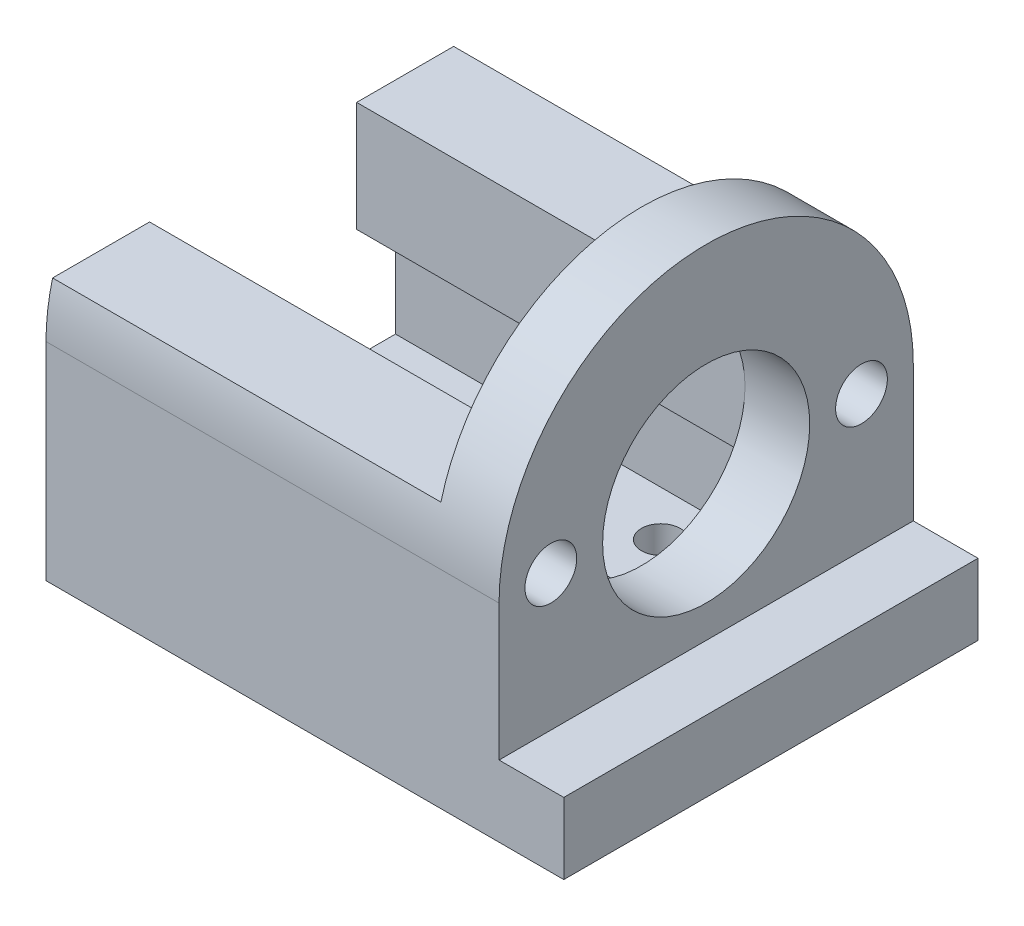
ISO-10303-21;
HEADER;
FILE_DESCRIPTION(('STEP AP214'),'2;1');
FILE_NAME('part.step','',(''),(''),'','','');
FILE_SCHEMA(('AUTOMOTIVE_DESIGN { 1 0 10303 214 1 1 1 1 }'));
ENDSEC;
DATA;
#1=APPLICATION_CONTEXT('core data for automotive mechanical design processes');
#2=APPLICATION_PROTOCOL_DEFINITION('international standard','automotive_design',2000,#1);
#3=PRODUCT_CONTEXT('',#1,'mechanical');
#4=PRODUCT('Part','Part','',(#3));
#5=PRODUCT_RELATED_PRODUCT_CATEGORY('part','',(#4));
#6=PRODUCT_DEFINITION_FORMATION('','',#4);
#7=PRODUCT_DEFINITION_CONTEXT('part definition',#1,'design');
#8=PRODUCT_DEFINITION('design','',#6,#7);
#9=PRODUCT_DEFINITION_SHAPE('','',#8);
#10=(LENGTH_UNIT() NAMED_UNIT(*) SI_UNIT(.MILLI.,.METRE.));
#11=(NAMED_UNIT(*) PLANE_ANGLE_UNIT() SI_UNIT($,.RADIAN.));
#12=(NAMED_UNIT(*) SI_UNIT($,.STERADIAN.) SOLID_ANGLE_UNIT());
#13=UNCERTAINTY_MEASURE_WITH_UNIT(LENGTH_MEASURE(1.E-05),#10,'distance_accuracy_value','');
#14=(GEOMETRIC_REPRESENTATION_CONTEXT(3) GLOBAL_UNCERTAINTY_ASSIGNED_CONTEXT((#13)) GLOBAL_UNIT_ASSIGNED_CONTEXT((#10,
#11,#12)) REPRESENTATION_CONTEXT('',''));
#15=CARTESIAN_POINT('',(0.,0.,0.));
#16=DIRECTION('',(0.,0.,1.));
#17=DIRECTION('',(1.,0.,0.));
#18=AXIS2_PLACEMENT_3D('',#15,#16,#17);
#19=CARTESIAN_POINT('',(0.,0.,0.));
#20=DIRECTION('',(1.,0.,0.));
#21=DIRECTION('',(0.,0.,-1.));
#22=AXIS2_PLACEMENT_3D('',#19,#20,#21);
#23=PLANE('',#22);
#24=DIRECTION('',(0.,0.,-1.));
#25=VECTOR('',#24,1.);
#26=CARTESIAN_POINT('',(0.,4.,0.));
#27=LINE('',#26,#25);
#28=CARTESIAN_POINT('',(0.,4.,15.4919333848297));
#29=VERTEX_POINT('',#28);
#30=CARTESIAN_POINT('',(0.,4.,8.));
#31=VERTEX_POINT('',#30);
#32=EDGE_CURVE('E254',#29,#31,#27,.T.);
#33=ORIENTED_EDGE('',*,*,#32,.F.);
#34=CARTESIAN_POINT('',(0.,0.,0.));
#35=DIRECTION('',(1.,0.,0.));
#36=DIRECTION('',(0.,0.,-1.));
#37=AXIS2_PLACEMENT_3D('',#34,#35,#36);
#38=CIRCLE('',#37,16.);
#39=CARTESIAN_POINT('',(0.,4.,-15.4919333848297));
#40=VERTEX_POINT('',#39);
#41=EDGE_CURVE('E61',#40,#29,#38,.T.);
#42=ORIENTED_EDGE('',*,*,#41,.F.);
#43=DIRECTION('',(0.,0.,1.));
#44=VECTOR('',#43,1.);
#45=CARTESIAN_POINT('',(0.,4.,0.));
#46=LINE('',#45,#44);
#47=CARTESIAN_POINT('',(0.,4.,-8.));
#48=VERTEX_POINT('',#47);
#49=EDGE_CURVE('E56',#40,#48,#46,.T.);
#50=ORIENTED_EDGE('',*,*,#49,.T.);
#51=DIRECTION('',(0.,-1.,0.));
#52=VECTOR('',#51,1.);
#53=CARTESIAN_POINT('',(0.,0.,-8.));
#54=LINE('',#53,#52);
#55=CARTESIAN_POINT('',(0.,0.,-8.));
#56=VERTEX_POINT('',#55);
#57=EDGE_CURVE('E318',#48,#56,#54,.T.);
#58=ORIENTED_EDGE('',*,*,#57,.T.);
#59=CARTESIAN_POINT('',(0.,0.,0.));
#60=DIRECTION('',(1.,0.,0.));
#61=DIRECTION('',(0.,0.,-1.));
#62=AXIS2_PLACEMENT_3D('',#59,#60,#61);
#63=CIRCLE('',#62,8.);
#64=CARTESIAN_POINT('',(0.,0.,8.));
#65=VERTEX_POINT('',#64);
#66=EDGE_CURVE('E373',#56,#65,#63,.T.);
#67=ORIENTED_EDGE('',*,*,#66,.T.);
#68=DIRECTION('',(0.,-1.,0.));
#69=VECTOR('',#68,1.);
#70=CARTESIAN_POINT('',(0.,0.,8.));
#71=LINE('',#70,#69);
#72=EDGE_CURVE('E277',#31,#65,#71,.T.);
#73=ORIENTED_EDGE('',*,*,#72,.F.);
#74=EDGE_LOOP('',(#33,#42,#50,#58,#67,#73));
#75=FACE_BOUND('',#74,.T.);
#76=ADVANCED_FACE('F41',(#75),#23,.F.);
#77=DIRECTION('',(0.,-1.,0.));
#78=VECTOR('',#77,1.);
#79=CARTESIAN_POINT('',(0.,0.,8.));
#80=LINE('',#79,#78);
#81=CARTESIAN_POINT('',(0.,-4.5,8.00000000000001));
#82=VERTEX_POINT('',#81);
#83=EDGE_CURVE('E385',#65,#82,#80,.T.);
#84=ORIENTED_EDGE('',*,*,#83,.F.);
#85=EDGE_CURVE('E372',#65,#56,#63,.T.);
#86=ORIENTED_EDGE('',*,*,#85,.T.);
#87=CARTESIAN_POINT('',(0.,-4.5,-8.));
#88=VERTEX_POINT('',#87);
#89=EDGE_CURVE('E208',#56,#88,#54,.T.);
#90=ORIENTED_EDGE('',*,*,#89,.T.);
#91=DIRECTION('',(0.,0.,-1.));
#92=VECTOR('',#91,1.);
#93=CARTESIAN_POINT('',(0.,-4.5,-8.));
#94=LINE('',#93,#92);
#95=CARTESIAN_POINT('',(0.,-4.5,-11.));
#96=VERTEX_POINT('',#95);
#97=EDGE_CURVE('E198',#88,#96,#94,.T.);
#98=ORIENTED_EDGE('',*,*,#97,.T.);
#99=DIRECTION('',(0.,-1.,0.));
#100=VECTOR('',#99,1.);
#101=CARTESIAN_POINT('',(0.,-13.,-11.));
#102=LINE('',#101,#100);
#103=CARTESIAN_POINT('',(0.,-13.,-11.));
#104=VERTEX_POINT('',#103);
#105=EDGE_CURVE('E185',#96,#104,#102,.T.);
#106=ORIENTED_EDGE('',*,*,#105,.T.);
#107=DIRECTION('',(0.,0.,1.));
#108=VECTOR('',#107,1.);
#109=CARTESIAN_POINT('',(0.,-13.,0.));
#110=LINE('',#109,#108);
#111=CARTESIAN_POINT('',(0.,-13.,-3.));
#112=VERTEX_POINT('',#111);
#113=EDGE_CURVE('E316',#104,#112,#110,.T.);
#114=ORIENTED_EDGE('',*,*,#113,.T.);
#115=DIRECTION('',(0.,1.,0.));
#116=VECTOR('',#115,1.);
#117=CARTESIAN_POINT('',(0.,0.,-3.));
#118=LINE('',#117,#116);
#119=CARTESIAN_POINT('',(0.,-16.,-3.));
#120=VERTEX_POINT('',#119);
#121=EDGE_CURVE('E292',#120,#112,#118,.T.);
#122=ORIENTED_EDGE('',*,*,#121,.F.);
#123=DIRECTION('',(0.,0.,-1.));
#124=VECTOR('',#123,1.);
#125=CARTESIAN_POINT('',(0.,-16.,0.));
#126=LINE('',#125,#124);
#127=CARTESIAN_POINT('',(0.,-16.,3.));
#128=VERTEX_POINT('',#127);
#129=EDGE_CURVE('E354',#128,#120,#126,.T.);
#130=ORIENTED_EDGE('',*,*,#129,.F.);
#131=DIRECTION('',(0.,1.,0.));
#132=VECTOR('',#131,1.);
#133=CARTESIAN_POINT('',(0.,0.,3.));
#134=LINE('',#133,#132);
#135=CARTESIAN_POINT('',(0.,-13.,3.));
#136=VERTEX_POINT('',#135);
#137=EDGE_CURVE('E259',#128,#136,#134,.T.);
#138=ORIENTED_EDGE('',*,*,#137,.T.);
#139=DIRECTION('',(0.,0.,-1.));
#140=VECTOR('',#139,1.);
#141=CARTESIAN_POINT('',(0.,-13.,0.));
#142=LINE('',#141,#140);
#143=CARTESIAN_POINT('',(0.,-13.,11.));
#144=VERTEX_POINT('',#143);
#145=EDGE_CURVE('E279',#144,#136,#142,.T.);
#146=ORIENTED_EDGE('',*,*,#145,.F.);
#147=DIRECTION('',(0.,1.,0.));
#148=VECTOR('',#147,1.);
#149=CARTESIAN_POINT('',(0.,-13.,11.));
#150=LINE('',#149,#148);
#151=CARTESIAN_POINT('',(0.,-4.5,11.));
#152=VERTEX_POINT('',#151);
#153=EDGE_CURVE('E220',#144,#152,#150,.T.);
#154=ORIENTED_EDGE('',*,*,#153,.T.);
#155=DIRECTION('',(0.,0.,-1.));
#156=VECTOR('',#155,1.);
#157=CARTESIAN_POINT('',(0.,-4.5,8.00000000000001));
#158=LINE('',#157,#156);
#159=EDGE_CURVE('E227',#152,#82,#158,.T.);
#160=ORIENTED_EDGE('',*,*,#159,.T.);
#161=EDGE_LOOP('',(#84,#86,#90,#98,#106,#114,#122,#130,#138,#146,#154,#160));
#162=FACE_BOUND('',#161,.T.);
#163=ADVANCED_FACE('F206',(#162),#23,.F.);
#164=CARTESIAN_POINT('',(5.,0.,-16.));
#165=DIRECTION('',(0.,0.,1.));
#166=DIRECTION('',(0.,-1.,0.));
#167=AXIS2_PLACEMENT_3D('',#164,#165,#166);
#168=PLANE('',#167);
#169=DIRECTION('',(-1.,0.,0.));
#170=VECTOR('',#169,1.);
#171=CARTESIAN_POINT('',(5.,-16.,-16.));
#172=LINE('',#171,#170);
#173=CARTESIAN_POINT('',(10.,-16.,-16.));
#174=VERTEX_POINT('',#173);
#175=CARTESIAN_POINT('',(-30.,-16.,-16.));
#176=VERTEX_POINT('',#175);
#177=EDGE_CURVE('E366',#174,#176,#172,.T.);
#178=ORIENTED_EDGE('',*,*,#177,.T.);
#179=DIRECTION('',(0.,-1.,0.));
#180=VECTOR('',#179,1.);
#181=CARTESIAN_POINT('',(-30.,0.,-16.));
#182=LINE('',#181,#180);
#183=CARTESIAN_POINT('',(-30.,0.,-16.));
#184=VERTEX_POINT('',#183);
#185=EDGE_CURVE('E310',#184,#176,#182,.T.);
#186=ORIENTED_EDGE('',*,*,#185,.F.);
#187=DIRECTION('',(-1.,0.,0.));
#188=VECTOR('',#187,1.);
#189=CARTESIAN_POINT('',(5.,0.,-16.));
#190=LINE('',#189,#188);
#191=CARTESIAN_POINT('',(5.,0.,-16.));
#192=VERTEX_POINT('',#191);
#193=EDGE_CURVE('E383',#192,#184,#190,.T.);
#194=ORIENTED_EDGE('',*,*,#193,.F.);
#195=DIRECTION('',(0.,1.,0.));
#196=VECTOR('',#195,1.);
#197=CARTESIAN_POINT('',(5.,0.,-16.));
#198=LINE('',#197,#196);
#199=CARTESIAN_POINT('',(5.,-10.5,-16.));
#200=VERTEX_POINT('',#199);
#201=EDGE_CURVE('E360',#200,#192,#198,.T.);
#202=ORIENTED_EDGE('',*,*,#201,.F.);
#203=DIRECTION('',(-1.,0.,0.));
#204=VECTOR('',#203,1.);
#205=CARTESIAN_POINT('',(10.,-10.5,-16.));
#206=LINE('',#205,#204);
#207=CARTESIAN_POINT('',(10.,-10.5,-16.));
#208=VERTEX_POINT('',#207);
#209=EDGE_CURVE('E346',#208,#200,#206,.T.);
#210=ORIENTED_EDGE('',*,*,#209,.F.);
#211=DIRECTION('',(0.,1.,0.));
#212=VECTOR('',#211,1.);
#213=CARTESIAN_POINT('',(10.,-16.,-16.));
#214=LINE('',#213,#212);
#215=EDGE_CURVE('E337',#174,#208,#214,.T.);
#216=ORIENTED_EDGE('',*,*,#215,.F.);
#217=EDGE_LOOP('',(#178,#186,#194,#202,#210,#216));
#218=FACE_BOUND('',#217,.T.);
#219=ADVANCED_FACE('F449',(#218),#168,.F.);
#220=CARTESIAN_POINT('',(5.,0.,0.));
#221=DIRECTION('',(-1.,0.,0.));
#222=DIRECTION('',(0.,0.,1.));
#223=AXIS2_PLACEMENT_3D('',#220,#221,#222);
#224=CYLINDRICAL_SURFACE('',#223,16.);
#225=ORIENTED_EDGE('',*,*,#193,.T.);
#226=CARTESIAN_POINT('',(-30.,0.,0.));
#227=DIRECTION('',(-1.,0.,0.));
#228=DIRECTION('',(0.,0.,1.));
#229=AXIS2_PLACEMENT_3D('',#226,#227,#228);
#230=CIRCLE('',#229,16.);
#231=CARTESIAN_POINT('',(-30.,4.,-15.4919333848297));
#232=VERTEX_POINT('',#231);
#233=EDGE_CURVE('E307',#232,#184,#230,.T.);
#234=ORIENTED_EDGE('',*,*,#233,.F.);
#235=DIRECTION('',(1.,0.,0.));
#236=VECTOR('',#235,1.);
#237=CARTESIAN_POINT('',(-30.,4.,-15.4919333848297));
#238=LINE('',#237,#236);
#239=EDGE_CURVE('E313',#232,#40,#238,.T.);
#240=ORIENTED_EDGE('',*,*,#239,.T.);
#241=ORIENTED_EDGE('',*,*,#41,.T.);
#242=DIRECTION('',(1.,0.,0.));
#243=VECTOR('',#242,1.);
#244=CARTESIAN_POINT('',(-30.,4.,15.4919333848297));
#245=LINE('',#244,#243);
#246=CARTESIAN_POINT('',(-30.,4.,15.4919333848297));
#247=VERTEX_POINT('',#246);
#248=EDGE_CURVE('E290',#247,#29,#245,.T.);
#249=ORIENTED_EDGE('',*,*,#248,.F.);
#250=CARTESIAN_POINT('',(-30.,0.,0.));
#251=DIRECTION('',(-1.,0.,0.));
#252=DIRECTION('',(0.,0.,1.));
#253=AXIS2_PLACEMENT_3D('',#250,#251,#252);
#254=CIRCLE('',#253,16.);
#255=CARTESIAN_POINT('',(-30.,0.,16.));
#256=VERTEX_POINT('',#255);
#257=EDGE_CURVE('E255',#256,#247,#254,.T.);
#258=ORIENTED_EDGE('',*,*,#257,.F.);
#259=DIRECTION('',(-1.,0.,0.));
#260=VECTOR('',#259,1.);
#261=CARTESIAN_POINT('',(5.,0.,16.));
#262=LINE('',#261,#260);
#263=CARTESIAN_POINT('',(5.,0.,16.));
#264=VERTEX_POINT('',#263);
#265=EDGE_CURVE('E381',#264,#256,#262,.T.);
#266=ORIENTED_EDGE('',*,*,#265,.F.);
#267=CARTESIAN_POINT('',(5.,0.,0.));
#268=DIRECTION('',(1.,0.,0.));
#269=DIRECTION('',(0.,0.,-1.));
#270=AXIS2_PLACEMENT_3D('',#267,#268,#269);
#271=CIRCLE('',#270,16.);
#272=EDGE_CURVE('E362',#192,#264,#271,.T.);
#273=ORIENTED_EDGE('',*,*,#272,.F.);
#274=EDGE_LOOP('',(#225,#234,#240,#241,#249,#258,#266,#273));
#275=FACE_BOUND('',#274,.T.);
#276=ADVANCED_FACE('F444',(#275),#224,.T.);
#277=CARTESIAN_POINT('',(5.,0.,16.));
#278=DIRECTION('',(0.,0.,-1.));
#279=DIRECTION('',(0.,1.,0.));
#280=AXIS2_PLACEMENT_3D('',#277,#278,#279);
#281=PLANE('',#280);
#282=ORIENTED_EDGE('',*,*,#265,.T.);
#283=DIRECTION('',(0.,1.,0.));
#284=VECTOR('',#283,1.);
#285=CARTESIAN_POINT('',(-30.,0.,16.));
#286=LINE('',#285,#284);
#287=CARTESIAN_POINT('',(-30.,-16.,16.));
#288=VERTEX_POINT('',#287);
#289=EDGE_CURVE('E272',#288,#256,#286,.T.);
#290=ORIENTED_EDGE('',*,*,#289,.F.);
#291=DIRECTION('',(-1.,0.,0.));
#292=VECTOR('',#291,1.);
#293=CARTESIAN_POINT('',(5.,-16.,16.));
#294=LINE('',#293,#292);
#295=CARTESIAN_POINT('',(10.,-16.,16.));
#296=VERTEX_POINT('',#295);
#297=EDGE_CURVE('E379',#296,#288,#294,.T.);
#298=ORIENTED_EDGE('',*,*,#297,.F.);
#299=DIRECTION('',(0.,-1.,0.));
#300=VECTOR('',#299,1.);
#301=CARTESIAN_POINT('',(10.,-16.,16.));
#302=LINE('',#301,#300);
#303=CARTESIAN_POINT('',(10.,-10.5,16.));
#304=VERTEX_POINT('',#303);
#305=EDGE_CURVE('E331',#304,#296,#302,.T.);
#306=ORIENTED_EDGE('',*,*,#305,.F.);
#307=DIRECTION('',(-1.,0.,0.));
#308=VECTOR('',#307,1.);
#309=CARTESIAN_POINT('',(10.,-10.5,16.));
#310=LINE('',#309,#308);
#311=CARTESIAN_POINT('',(5.,-10.5,16.));
#312=VERTEX_POINT('',#311);
#313=EDGE_CURVE('E341',#304,#312,#310,.T.);
#314=ORIENTED_EDGE('',*,*,#313,.T.);
#315=DIRECTION('',(0.,-1.,0.));
#316=VECTOR('',#315,1.);
#317=CARTESIAN_POINT('',(5.,0.,16.));
#318=LINE('',#317,#316);
#319=EDGE_CURVE('E364',#264,#312,#318,.T.);
#320=ORIENTED_EDGE('',*,*,#319,.F.);
#321=EDGE_LOOP('',(#282,#290,#298,#306,#314,#320));
#322=FACE_BOUND('',#321,.T.);
#323=ADVANCED_FACE('F460',(#322),#281,.F.);
#324=CARTESIAN_POINT('',(5.,0.,0.));
#325=DIRECTION('',(-1.,0.,0.));
#326=DIRECTION('',(0.,0.,1.));
#327=AXIS2_PLACEMENT_3D('',#324,#325,#326);
#328=CYLINDRICAL_SURFACE('',#327,8.);
#329=CARTESIAN_POINT('',(5.,0.,0.));
#330=DIRECTION('',(1.,0.,0.));
#331=DIRECTION('',(0.,0.,-1.));
#332=AXIS2_PLACEMENT_3D('',#329,#330,#331);
#333=CIRCLE('',#332,8.);
#334=CARTESIAN_POINT('',(5.,0.,-8.));
#335=VERTEX_POINT('',#334);
#336=EDGE_CURVE('E357',#335,#335,#333,.T.);
#337=ORIENTED_EDGE('',*,*,#336,.T.);
#338=EDGE_LOOP('',(#337));
#339=FACE_BOUND('',#338,.T.);
#340=ORIENTED_EDGE('',*,*,#66,.F.);
#341=ORIENTED_EDGE('',*,*,#85,.F.);
#342=EDGE_LOOP('',(#340,#341));
#343=FACE_BOUND('',#342,.T.);
#344=ADVANCED_FACE('F437',(#339,#343),#328,.F.);
#345=CARTESIAN_POINT('',(5.,0.,12.));
#346=DIRECTION('',(-1.,0.,0.));
#347=DIRECTION('',(0.,0.,1.));
#348=AXIS2_PLACEMENT_3D('',#345,#346,#347);
#349=CYLINDRICAL_SURFACE('',#348,2.);
#350=CARTESIAN_POINT('',(5.,0.,12.));
#351=DIRECTION('',(1.,0.,0.));
#352=DIRECTION('',(0.,0.,-1.));
#353=AXIS2_PLACEMENT_3D('',#350,#351,#352);
#354=CIRCLE('',#353,2.);
#355=CARTESIAN_POINT('',(5.,0.,10.));
#356=VERTEX_POINT('',#355);
#357=EDGE_CURVE('E353',#356,#356,#354,.T.);
#358=ORIENTED_EDGE('',*,*,#357,.T.);
#359=EDGE_LOOP('',(#358));
#360=FACE_BOUND('',#359,.T.);
#361=CARTESIAN_POINT('',(0.,0.,12.));
#362=DIRECTION('',(1.,0.,0.));
#363=DIRECTION('',(0.,0.,-1.));
#364=AXIS2_PLACEMENT_3D('',#361,#362,#363);
#365=CIRCLE('',#364,2.);
#366=CARTESIAN_POINT('',(0.,0.,10.));
#367=VERTEX_POINT('',#366);
#368=EDGE_CURVE('E369',#367,#367,#365,.T.);
#369=ORIENTED_EDGE('',*,*,#368,.F.);
#370=EDGE_LOOP('',(#369));
#371=FACE_BOUND('',#370,.T.);
#372=ADVANCED_FACE('F499',(#360,#371),#349,.F.);
#373=CARTESIAN_POINT('',(5.,0.,-12.));
#374=DIRECTION('',(-1.,0.,0.));
#375=DIRECTION('',(0.,0.,1.));
#376=AXIS2_PLACEMENT_3D('',#373,#374,#375);
#377=CYLINDRICAL_SURFACE('',#376,2.);
#378=CARTESIAN_POINT('',(5.,0.,-12.));
#379=DIRECTION('',(1.,0.,0.));
#380=DIRECTION('',(0.,0.,-1.));
#381=AXIS2_PLACEMENT_3D('',#378,#379,#380);
#382=CIRCLE('',#381,2.);
#383=CARTESIAN_POINT('',(5.,0.,-14.));
#384=VERTEX_POINT('',#383);
#385=EDGE_CURVE('E350',#384,#384,#382,.T.);
#386=ORIENTED_EDGE('',*,*,#385,.T.);
#387=EDGE_LOOP('',(#386));
#388=FACE_BOUND('',#387,.T.);
#389=CARTESIAN_POINT('',(0.,0.,-12.));
#390=DIRECTION('',(1.,0.,0.));
#391=DIRECTION('',(0.,0.,-1.));
#392=AXIS2_PLACEMENT_3D('',#389,#390,#391);
#393=CIRCLE('',#392,2.);
#394=CARTESIAN_POINT('',(0.,0.,-14.));
#395=VERTEX_POINT('',#394);
#396=EDGE_CURVE('E349',#395,#395,#393,.T.);
#397=ORIENTED_EDGE('',*,*,#396,.F.);
#398=EDGE_LOOP('',(#397));
#399=FACE_BOUND('',#398,.T.);
#400=ADVANCED_FACE('F43',(#388,#399),#377,.F.);
#401=CARTESIAN_POINT('',(5.,-16.,0.));
#402=DIRECTION('',(0.,1.,0.));
#403=DIRECTION('',(0.,0.,1.));
#404=AXIS2_PLACEMENT_3D('',#401,#402,#403);
#405=PLANE('',#404);
#406=CARTESIAN_POINT('',(-26.,-16.,7.5));
#407=DIRECTION('',(0.,1.,0.));
#408=DIRECTION('',(0.,0.,1.));
#409=AXIS2_PLACEMENT_3D('',#406,#407,#408);
#410=CIRCLE('',#409,1.5);
#411=CARTESIAN_POINT('',(-26.,-16.,9.));
#412=VERTEX_POINT('',#411);
#413=EDGE_CURVE('E245',#412,#412,#410,.T.);
#414=ORIENTED_EDGE('',*,*,#413,.T.);
#415=EDGE_LOOP('',(#414));
#416=FACE_BOUND('',#415,.T.);
#417=CARTESIAN_POINT('',(-26.,-16.,-7.5));
#418=DIRECTION('',(0.,1.,0.));
#419=DIRECTION('',(0.,0.,1.));
#420=AXIS2_PLACEMENT_3D('',#417,#418,#419);
#421=CIRCLE('',#420,1.5);
#422=CARTESIAN_POINT('',(-26.,-16.,-6.));
#423=VERTEX_POINT('',#422);
#424=EDGE_CURVE('E251',#423,#423,#421,.T.);
#425=ORIENTED_EDGE('',*,*,#424,.T.);
#426=EDGE_LOOP('',(#425));
#427=FACE_BOUND('',#426,.T.);
#428=CARTESIAN_POINT('',(-6.,-16.,-7.5));
#429=DIRECTION('',(0.,1.,0.));
#430=DIRECTION('',(0.,0.,1.));
#431=AXIS2_PLACEMENT_3D('',#428,#429,#430);
#432=CIRCLE('',#431,1.5);
#433=CARTESIAN_POINT('',(-6.,-16.,-6.));
#434=VERTEX_POINT('',#433);
#435=EDGE_CURVE('E248',#434,#434,#432,.T.);
#436=ORIENTED_EDGE('',*,*,#435,.T.);
#437=EDGE_LOOP('',(#436));
#438=FACE_BOUND('',#437,.T.);
#439=CARTESIAN_POINT('',(-6.,-16.,7.5));
#440=DIRECTION('',(0.,1.,0.));
#441=DIRECTION('',(0.,0.,1.));
#442=AXIS2_PLACEMENT_3D('',#439,#440,#441);
#443=CIRCLE('',#442,1.5);
#444=CARTESIAN_POINT('',(-6.,-16.,9.));
#445=VERTEX_POINT('',#444);
#446=EDGE_CURVE('E242',#445,#445,#443,.T.);
#447=ORIENTED_EDGE('',*,*,#446,.T.);
#448=EDGE_LOOP('',(#447));
#449=FACE_BOUND('',#448,.T.);
#450=ORIENTED_EDGE('',*,*,#297,.T.);
#451=DIRECTION('',(0.,0.,1.));
#452=VECTOR('',#451,1.);
#453=CARTESIAN_POINT('',(-30.,-16.,0.));
#454=LINE('',#453,#452);
#455=CARTESIAN_POINT('',(-30.,-16.,3.));
#456=VERTEX_POINT('',#455);
#457=EDGE_CURVE('E269',#456,#288,#454,.T.);
#458=ORIENTED_EDGE('',*,*,#457,.F.);
#459=DIRECTION('',(1.,0.,0.));
#460=VECTOR('',#459,1.);
#461=CARTESIAN_POINT('',(-30.,-16.,3.));
#462=LINE('',#461,#460);
#463=EDGE_CURVE('E275',#456,#128,#462,.T.);
#464=ORIENTED_EDGE('',*,*,#463,.T.);
#465=ORIENTED_EDGE('',*,*,#129,.T.);
#466=DIRECTION('',(1.,0.,0.));
#467=VECTOR('',#466,1.);
#468=CARTESIAN_POINT('',(-30.,-16.,-3.));
#469=LINE('',#468,#467);
#470=CARTESIAN_POINT('',(-30.,-16.,-3.));
#471=VERTEX_POINT('',#470);
#472=EDGE_CURVE('E327',#471,#120,#469,.T.);
#473=ORIENTED_EDGE('',*,*,#472,.F.);
#474=DIRECTION('',(0.,0.,1.));
#475=VECTOR('',#474,1.);
#476=CARTESIAN_POINT('',(-30.,-16.,0.));
#477=LINE('',#476,#475);
#478=EDGE_CURVE('E293',#176,#471,#477,.T.);
#479=ORIENTED_EDGE('',*,*,#478,.F.);
#480=ORIENTED_EDGE('',*,*,#177,.F.);
#481=DIRECTION('',(0.,0.,-1.));
#482=VECTOR('',#481,1.);
#483=CARTESIAN_POINT('',(10.,-16.,16.));
#484=LINE('',#483,#482);
#485=EDGE_CURVE('E334',#296,#174,#484,.T.);
#486=ORIENTED_EDGE('',*,*,#485,.F.);
#487=EDGE_LOOP('',(#450,#458,#464,#465,#473,#479,#480,#486));
#488=FACE_BOUND('',#487,.T.);
#489=ADVANCED_FACE('F411',(#416,#427,#438,#449,#488),#405,.F.);
#490=CARTESIAN_POINT('',(5.,0.,0.));
#491=DIRECTION('',(1.,0.,0.));
#492=DIRECTION('',(0.,0.,-1.));
#493=AXIS2_PLACEMENT_3D('',#490,#491,#492);
#494=PLANE('',#493);
#495=DIRECTION('',(0.,0.,1.));
#496=VECTOR('',#495,1.);
#497=CARTESIAN_POINT('',(5.,-10.5,16.));
#498=LINE('',#497,#496);
#499=EDGE_CURVE('E330',#200,#312,#498,.T.);
#500=ORIENTED_EDGE('',*,*,#499,.F.);
#501=ORIENTED_EDGE('',*,*,#201,.T.);
#502=ORIENTED_EDGE('',*,*,#272,.T.);
#503=ORIENTED_EDGE('',*,*,#319,.T.);
#504=EDGE_LOOP('',(#500,#501,#502,#503));
#505=FACE_BOUND('',#504,.T.);
#506=ORIENTED_EDGE('',*,*,#385,.F.);
#507=EDGE_LOOP('',(#506));
#508=FACE_BOUND('',#507,.T.);
#509=ORIENTED_EDGE('',*,*,#357,.F.);
#510=EDGE_LOOP('',(#509));
#511=FACE_BOUND('',#510,.T.);
#512=ORIENTED_EDGE('',*,*,#336,.F.);
#513=EDGE_LOOP('',(#512));
#514=FACE_BOUND('',#513,.T.);
#515=ADVANCED_FACE('F471',(#505,#508,#511,#514),#494,.T.);
#516=CARTESIAN_POINT('',(10.,-10.5,16.));
#517=DIRECTION('',(0.,-1.,0.));
#518=DIRECTION('',(0.,0.,-1.));
#519=AXIS2_PLACEMENT_3D('',#516,#517,#518);
#520=PLANE('',#519);
#521=ORIENTED_EDGE('',*,*,#499,.T.);
#522=ORIENTED_EDGE('',*,*,#313,.F.);
#523=DIRECTION('',(0.,0.,1.));
#524=VECTOR('',#523,1.);
#525=CARTESIAN_POINT('',(10.,-10.5,16.));
#526=LINE('',#525,#524);
#527=EDGE_CURVE('E339',#208,#304,#526,.T.);
#528=ORIENTED_EDGE('',*,*,#527,.F.);
#529=ORIENTED_EDGE('',*,*,#209,.T.);
#530=EDGE_LOOP('',(#521,#522,#528,#529));
#531=FACE_BOUND('',#530,.T.);
#532=ADVANCED_FACE('F474',(#531),#520,.F.);
#533=CARTESIAN_POINT('',(10.,0.,0.));
#534=DIRECTION('',(-1.,0.,0.));
#535=DIRECTION('',(0.,0.,1.));
#536=AXIS2_PLACEMENT_3D('',#533,#534,#535);
#537=PLANE('',#536);
#538=ORIENTED_EDGE('',*,*,#305,.T.);
#539=ORIENTED_EDGE('',*,*,#485,.T.);
#540=ORIENTED_EDGE('',*,*,#215,.T.);
#541=ORIENTED_EDGE('',*,*,#527,.T.);
#542=EDGE_LOOP('',(#538,#539,#540,#541));
#543=FACE_BOUND('',#542,.T.);
#544=ADVANCED_FACE('F455',(#543),#537,.F.);
#545=CARTESIAN_POINT('',(-30.,0.,0.));
#546=DIRECTION('',(-1.,0.,0.));
#547=DIRECTION('',(0.,0.,1.));
#548=AXIS2_PLACEMENT_3D('',#545,#546,#547);
#549=PLANE('',#548);
#550=DIRECTION('',(0.,0.,-1.));
#551=VECTOR('',#550,1.);
#552=CARTESIAN_POINT('',(-30.,-4.5,-8.));
#553=LINE('',#552,#551);
#554=CARTESIAN_POINT('',(-30.,-4.5,-8.));
#555=VERTEX_POINT('',#554);
#556=CARTESIAN_POINT('',(-30.,-4.5,-11.));
#557=VERTEX_POINT('',#556);
#558=EDGE_CURVE('E201',#555,#557,#553,.T.);
#559=ORIENTED_EDGE('',*,*,#558,.F.);
#560=DIRECTION('',(0.,-1.,0.));
#561=VECTOR('',#560,1.);
#562=CARTESIAN_POINT('',(-30.,0.,-8.));
#563=LINE('',#562,#561);
#564=CARTESIAN_POINT('',(-30.,4.,-8.));
#565=VERTEX_POINT('',#564);
#566=EDGE_CURVE('E301',#565,#555,#563,.T.);
#567=ORIENTED_EDGE('',*,*,#566,.F.);
#568=DIRECTION('',(0.,0.,1.));
#569=VECTOR('',#568,1.);
#570=CARTESIAN_POINT('',(-30.,4.,0.));
#571=LINE('',#570,#569);
#572=EDGE_CURVE('E304',#232,#565,#571,.T.);
#573=ORIENTED_EDGE('',*,*,#572,.F.);
#574=ORIENTED_EDGE('',*,*,#233,.T.);
#575=ORIENTED_EDGE('',*,*,#185,.T.);
#576=ORIENTED_EDGE('',*,*,#478,.T.);
#577=DIRECTION('',(0.,1.,0.));
#578=VECTOR('',#577,1.);
#579=CARTESIAN_POINT('',(-30.,0.,-3.));
#580=LINE('',#579,#578);
#581=CARTESIAN_POINT('',(-30.,-13.,-3.));
#582=VERTEX_POINT('',#581);
#583=EDGE_CURVE('E296',#471,#582,#580,.T.);
#584=ORIENTED_EDGE('',*,*,#583,.T.);
#585=DIRECTION('',(0.,0.,1.));
#586=VECTOR('',#585,1.);
#587=CARTESIAN_POINT('',(-30.,-13.,0.));
#588=LINE('',#587,#586);
#589=CARTESIAN_POINT('',(-30.,-13.,-11.));
#590=VERTEX_POINT('',#589);
#591=EDGE_CURVE('E298',#590,#582,#588,.T.);
#592=ORIENTED_EDGE('',*,*,#591,.F.);
#593=DIRECTION('',(0.,-1.,0.));
#594=VECTOR('',#593,1.);
#595=CARTESIAN_POINT('',(-30.,-13.,-11.));
#596=LINE('',#595,#594);
#597=EDGE_CURVE('E209',#557,#590,#596,.T.);
#598=ORIENTED_EDGE('',*,*,#597,.F.);
#599=EDGE_LOOP('',(#559,#567,#573,#574,#575,#576,#584,#592,#598));
#600=FACE_BOUND('',#599,.T.);
#601=ADVANCED_FACE('F401',(#600),#549,.T.);
#602=CARTESIAN_POINT('',(-30.,4.,0.));
#603=DIRECTION('',(0.,1.,0.));
#604=DIRECTION('',(0.,0.,1.));
#605=AXIS2_PLACEMENT_3D('',#602,#603,#604);
#606=PLANE('',#605);
#607=ORIENTED_EDGE('',*,*,#49,.F.);
#608=ORIENTED_EDGE('',*,*,#239,.F.);
#609=ORIENTED_EDGE('',*,*,#572,.T.);
#610=DIRECTION('',(1.,0.,0.));
#611=VECTOR('',#610,1.);
#612=CARTESIAN_POINT('',(-30.,4.,-8.));
#613=LINE('',#612,#611);
#614=EDGE_CURVE('E322',#565,#48,#613,.T.);
#615=ORIENTED_EDGE('',*,*,#614,.T.);
#616=EDGE_LOOP('',(#607,#608,#609,#615));
#617=FACE_BOUND('',#616,.T.);
#618=ADVANCED_FACE('F441',(#617),#606,.T.);
#619=CARTESIAN_POINT('',(-30.,0.,-8.));
#620=DIRECTION('',(0.,0.,1.));
#621=DIRECTION('',(0.,-1.,0.));
#622=AXIS2_PLACEMENT_3D('',#619,#620,#621);
#623=PLANE('',#622);
#624=DIRECTION('',(-1.,0.,0.));
#625=VECTOR('',#624,1.);
#626=CARTESIAN_POINT('',(9.01387818865998,-4.5,-8.));
#627=LINE('',#626,#625);
#628=EDGE_CURVE('E214',#88,#555,#627,.T.);
#629=ORIENTED_EDGE('',*,*,#628,.F.);
#630=ORIENTED_EDGE('',*,*,#89,.F.);
#631=ORIENTED_EDGE('',*,*,#57,.F.);
#632=ORIENTED_EDGE('',*,*,#614,.F.);
#633=ORIENTED_EDGE('',*,*,#566,.T.);
#634=EDGE_LOOP('',(#629,#630,#631,#632,#633));
#635=FACE_BOUND('',#634,.T.);
#636=ADVANCED_FACE('F397',(#635),#623,.T.);
#637=CARTESIAN_POINT('',(-30.,-13.,0.));
#638=DIRECTION('',(0.,1.,0.));
#639=DIRECTION('',(0.,0.,1.));
#640=AXIS2_PLACEMENT_3D('',#637,#638,#639);
#641=PLANE('',#640);
#642=CARTESIAN_POINT('',(-26.,-13.,-7.5));
#643=DIRECTION('',(0.,1.,0.));
#644=DIRECTION('',(0.,0.,1.));
#645=AXIS2_PLACEMENT_3D('',#642,#643,#644);
#646=CIRCLE('',#645,1.5);
#647=CARTESIAN_POINT('',(-26.,-13.,-6.));
#648=VERTEX_POINT('',#647);
#649=EDGE_CURVE('E11',#648,#648,#646,.T.);
#650=ORIENTED_EDGE('',*,*,#649,.F.);
#651=EDGE_LOOP('',(#650));
#652=FACE_BOUND('',#651,.T.);
#653=CARTESIAN_POINT('',(-6.,-13.,-7.5));
#654=DIRECTION('',(0.,1.,0.));
#655=DIRECTION('',(0.,0.,1.));
#656=AXIS2_PLACEMENT_3D('',#653,#654,#655);
#657=CIRCLE('',#656,1.5);
#658=CARTESIAN_POINT('',(-6.,-13.,-6.));
#659=VERTEX_POINT('',#658);
#660=EDGE_CURVE('E49',#659,#659,#657,.T.);
#661=ORIENTED_EDGE('',*,*,#660,.F.);
#662=EDGE_LOOP('',(#661));
#663=FACE_BOUND('',#662,.T.);
#664=DIRECTION('',(-1.,0.,0.));
#665=VECTOR('',#664,1.);
#666=CARTESIAN_POINT('',(9.01387818865998,-13.,-11.));
#667=LINE('',#666,#665);
#668=EDGE_CURVE('E192',#104,#590,#667,.T.);
#669=ORIENTED_EDGE('',*,*,#668,.T.);
#670=ORIENTED_EDGE('',*,*,#591,.T.);
#671=DIRECTION('',(1.,0.,0.));
#672=VECTOR('',#671,1.);
#673=CARTESIAN_POINT('',(-30.,-13.,-3.));
#674=LINE('',#673,#672);
#675=EDGE_CURVE('E324',#582,#112,#674,.T.);
#676=ORIENTED_EDGE('',*,*,#675,.T.);
#677=ORIENTED_EDGE('',*,*,#113,.F.);
#678=EDGE_LOOP('',(#669,#670,#676,#677));
#679=FACE_BOUND('',#678,.T.);
#680=ADVANCED_FACE('F393',(#652,#663,#679),#641,.T.);
#681=CARTESIAN_POINT('',(-30.,0.,-3.));
#682=DIRECTION('',(0.,0.,-1.));
#683=DIRECTION('',(0.,1.,0.));
#684=AXIS2_PLACEMENT_3D('',#681,#682,#683);
#685=PLANE('',#684);
#686=ORIENTED_EDGE('',*,*,#121,.T.);
#687=ORIENTED_EDGE('',*,*,#675,.F.);
#688=ORIENTED_EDGE('',*,*,#583,.F.);
#689=ORIENTED_EDGE('',*,*,#472,.T.);
#690=EDGE_LOOP('',(#686,#687,#688,#689));
#691=FACE_BOUND('',#690,.T.);
#692=ADVANCED_FACE('F396',(#691),#685,.F.);
#693=CARTESIAN_POINT('',(0.,0.,0.));
#694=DIRECTION('',(-1.,0.,0.));
#695=DIRECTION('',(0.,0.,1.));
#696=AXIS2_PLACEMENT_3D('',#693,#694,#695);
#697=PLANE('',#696);
#698=ORIENTED_EDGE('',*,*,#396,.T.);
#699=EDGE_LOOP('',(#698));
#700=FACE_BOUND('',#699,.T.);
#701=ADVANCED_FACE('F534',(#700),#697,.F.);
#702=CARTESIAN_POINT('',(-30.,0.,0.));
#703=DIRECTION('',(-1.,0.,0.));
#704=DIRECTION('',(0.,0.,1.));
#705=AXIS2_PLACEMENT_3D('',#702,#703,#704);
#706=PLANE('',#705);
#707=DIRECTION('',(0.,0.,-1.));
#708=VECTOR('',#707,1.);
#709=CARTESIAN_POINT('',(-30.,-4.5,8.00000000000001));
#710=LINE('',#709,#708);
#711=CARTESIAN_POINT('',(-30.,-4.5,11.));
#712=VERTEX_POINT('',#711);
#713=CARTESIAN_POINT('',(-30.,-4.5,8.00000000000001));
#714=VERTEX_POINT('',#713);
#715=EDGE_CURVE('E218',#712,#714,#710,.T.);
#716=ORIENTED_EDGE('',*,*,#715,.F.);
#717=DIRECTION('',(0.,1.,0.));
#718=VECTOR('',#717,1.);
#719=CARTESIAN_POINT('',(-30.,-13.,11.));
#720=LINE('',#719,#718);
#721=CARTESIAN_POINT('',(-30.,-13.,11.));
#722=VERTEX_POINT('',#721);
#723=EDGE_CURVE('E221',#722,#712,#720,.T.);
#724=ORIENTED_EDGE('',*,*,#723,.F.);
#725=DIRECTION('',(0.,0.,-1.));
#726=VECTOR('',#725,1.);
#727=CARTESIAN_POINT('',(-30.,-13.,0.));
#728=LINE('',#727,#726);
#729=CARTESIAN_POINT('',(-30.,-13.,3.));
#730=VERTEX_POINT('',#729);
#731=EDGE_CURVE('E264',#722,#730,#728,.T.);
#732=ORIENTED_EDGE('',*,*,#731,.T.);
#733=DIRECTION('',(0.,1.,0.));
#734=VECTOR('',#733,1.);
#735=CARTESIAN_POINT('',(-30.,0.,3.));
#736=LINE('',#735,#734);
#737=EDGE_CURVE('E266',#456,#730,#736,.T.);
#738=ORIENTED_EDGE('',*,*,#737,.F.);
#739=ORIENTED_EDGE('',*,*,#457,.T.);
#740=ORIENTED_EDGE('',*,*,#289,.T.);
#741=ORIENTED_EDGE('',*,*,#257,.T.);
#742=DIRECTION('',(0.,0.,-1.));
#743=VECTOR('',#742,1.);
#744=CARTESIAN_POINT('',(-30.,4.,0.));
#745=LINE('',#744,#743);
#746=CARTESIAN_POINT('',(-30.,4.,8.));
#747=VERTEX_POINT('',#746);
#748=EDGE_CURVE('E258',#247,#747,#745,.T.);
#749=ORIENTED_EDGE('',*,*,#748,.T.);
#750=DIRECTION('',(0.,-1.,0.));
#751=VECTOR('',#750,1.);
#752=CARTESIAN_POINT('',(-30.,0.,8.));
#753=LINE('',#752,#751);
#754=EDGE_CURVE('E261',#747,#714,#753,.T.);
#755=ORIENTED_EDGE('',*,*,#754,.T.);
#756=EDGE_LOOP('',(#716,#724,#732,#738,#739,#740,#741,#749,#755));
#757=FACE_BOUND('',#756,.T.);
#758=ADVANCED_FACE('F464',(#757),#706,.T.);
#759=CARTESIAN_POINT('',(-30.,0.,3.));
#760=DIRECTION('',(0.,0.,-1.));
#761=DIRECTION('',(0.,1.,0.));
#762=AXIS2_PLACEMENT_3D('',#759,#760,#761);
#763=PLANE('',#762);
#764=ORIENTED_EDGE('',*,*,#137,.F.);
#765=ORIENTED_EDGE('',*,*,#463,.F.);
#766=ORIENTED_EDGE('',*,*,#737,.T.);
#767=DIRECTION('',(1.,0.,0.));
#768=VECTOR('',#767,1.);
#769=CARTESIAN_POINT('',(-30.,-13.,3.));
#770=LINE('',#769,#768);
#771=EDGE_CURVE('E285',#730,#136,#770,.T.);
#772=ORIENTED_EDGE('',*,*,#771,.T.);
#773=EDGE_LOOP('',(#764,#765,#766,#772));
#774=FACE_BOUND('',#773,.T.);
#775=ADVANCED_FACE('F415',(#774),#763,.T.);
#776=CARTESIAN_POINT('',(-30.,-13.,0.));
#777=DIRECTION('',(0.,-1.,0.));
#778=DIRECTION('',(0.,0.,-1.));
#779=AXIS2_PLACEMENT_3D('',#776,#777,#778);
#780=PLANE('',#779);
#781=CARTESIAN_POINT('',(-26.,-13.,7.5));
#782=DIRECTION('',(0.,1.,0.));
#783=DIRECTION('',(0.,0.,1.));
#784=AXIS2_PLACEMENT_3D('',#781,#782,#783);
#785=CIRCLE('',#784,1.5);
#786=CARTESIAN_POINT('',(-26.,-13.,9.));
#787=VERTEX_POINT('',#786);
#788=EDGE_CURVE('E217',#787,#787,#785,.T.);
#789=ORIENTED_EDGE('',*,*,#788,.F.);
#790=EDGE_LOOP('',(#789));
#791=FACE_BOUND('',#790,.T.);
#792=CARTESIAN_POINT('',(-6.,-13.,7.5));
#793=DIRECTION('',(0.,1.,0.));
#794=DIRECTION('',(0.,0.,1.));
#795=AXIS2_PLACEMENT_3D('',#792,#793,#794);
#796=CIRCLE('',#795,1.5);
#797=CARTESIAN_POINT('',(-6.,-13.,9.));
#798=VERTEX_POINT('',#797);
#799=EDGE_CURVE('E239',#798,#798,#796,.T.);
#800=ORIENTED_EDGE('',*,*,#799,.F.);
#801=EDGE_LOOP('',(#800));
#802=FACE_BOUND('',#801,.T.);
#803=ORIENTED_EDGE('',*,*,#731,.F.);
#804=DIRECTION('',(-1.,0.,0.));
#805=VECTOR('',#804,1.);
#806=CARTESIAN_POINT('',(9.01387818865998,-13.,11.));
#807=LINE('',#806,#805);
#808=EDGE_CURVE('E233',#144,#722,#807,.T.);
#809=ORIENTED_EDGE('',*,*,#808,.F.);
#810=ORIENTED_EDGE('',*,*,#145,.T.);
#811=ORIENTED_EDGE('',*,*,#771,.F.);
#812=EDGE_LOOP('',(#803,#809,#810,#811));
#813=FACE_BOUND('',#812,.T.);
#814=ADVANCED_FACE('F419',(#791,#802,#813),#780,.F.);
#815=CARTESIAN_POINT('',(-30.,0.,8.));
#816=DIRECTION('',(0.,0.,1.));
#817=DIRECTION('',(0.,-1.,0.));
#818=AXIS2_PLACEMENT_3D('',#815,#816,#817);
#819=PLANE('',#818);
#820=ORIENTED_EDGE('',*,*,#83,.T.);
#821=DIRECTION('',(-1.,0.,0.));
#822=VECTOR('',#821,1.);
#823=CARTESIAN_POINT('',(9.01387818865998,-4.5,8.00000000000001));
#824=LINE('',#823,#822);
#825=EDGE_CURVE('E230',#82,#714,#824,.T.);
#826=ORIENTED_EDGE('',*,*,#825,.T.);
#827=ORIENTED_EDGE('',*,*,#754,.F.);
#828=DIRECTION('',(1.,0.,0.));
#829=VECTOR('',#828,1.);
#830=CARTESIAN_POINT('',(-30.,4.,8.));
#831=LINE('',#830,#829);
#832=EDGE_CURVE('E287',#747,#31,#831,.T.);
#833=ORIENTED_EDGE('',*,*,#832,.T.);
#834=ORIENTED_EDGE('',*,*,#72,.T.);
#835=EDGE_LOOP('',(#820,#826,#827,#833,#834));
#836=FACE_BOUND('',#835,.T.);
#837=ADVANCED_FACE('F430',(#836),#819,.F.);
#838=CARTESIAN_POINT('',(-30.,4.,0.));
#839=DIRECTION('',(0.,-1.,0.));
#840=DIRECTION('',(0.,0.,-1.));
#841=AXIS2_PLACEMENT_3D('',#838,#839,#840);
#842=PLANE('',#841);
#843=ORIENTED_EDGE('',*,*,#32,.T.);
#844=ORIENTED_EDGE('',*,*,#832,.F.);
#845=ORIENTED_EDGE('',*,*,#748,.F.);
#846=ORIENTED_EDGE('',*,*,#248,.T.);
#847=EDGE_LOOP('',(#843,#844,#845,#846));
#848=FACE_BOUND('',#847,.T.);
#849=ADVANCED_FACE('F468',(#848),#842,.F.);
#850=CARTESIAN_POINT('',(0.,0.,0.));
#851=DIRECTION('',(-1.,0.,0.));
#852=DIRECTION('',(0.,0.,1.));
#853=AXIS2_PLACEMENT_3D('',#850,#851,#852);
#854=PLANE('',#853);
#855=ORIENTED_EDGE('',*,*,#368,.T.);
#856=EDGE_LOOP('',(#855));
#857=FACE_BOUND('',#856,.T.);
#858=ADVANCED_FACE('F511',(#857),#854,.F.);
#859=CARTESIAN_POINT('',(-6.,-33.,7.5));
#860=DIRECTION('',(0.,1.,0.));
#861=DIRECTION('',(0.,0.,1.));
#862=AXIS2_PLACEMENT_3D('',#859,#860,#861);
#863=CYLINDRICAL_SURFACE('',#862,1.5);
#864=ORIENTED_EDGE('',*,*,#799,.T.);
#865=EDGE_LOOP('',(#864));
#866=FACE_BOUND('',#865,.T.);
#867=ORIENTED_EDGE('',*,*,#446,.F.);
#868=EDGE_LOOP('',(#867));
#869=FACE_BOUND('',#868,.T.);
#870=ADVANCED_FACE('F513',(#866,#869),#863,.F.);
#871=CARTESIAN_POINT('',(-26.,-33.,7.5));
#872=DIRECTION('',(0.,1.,0.));
#873=DIRECTION('',(0.,0.,1.));
#874=AXIS2_PLACEMENT_3D('',#871,#872,#873);
#875=CYLINDRICAL_SURFACE('',#874,1.5);
#876=ORIENTED_EDGE('',*,*,#788,.T.);
#877=EDGE_LOOP('',(#876));
#878=FACE_BOUND('',#877,.T.);
#879=ORIENTED_EDGE('',*,*,#413,.F.);
#880=EDGE_LOOP('',(#879));
#881=FACE_BOUND('',#880,.T.);
#882=ADVANCED_FACE('F519',(#878,#881),#875,.F.);
#883=CARTESIAN_POINT('',(-6.,-33.,-7.5));
#884=DIRECTION('',(0.,1.,0.));
#885=DIRECTION('',(0.,0.,1.));
#886=AXIS2_PLACEMENT_3D('',#883,#884,#885);
#887=CYLINDRICAL_SURFACE('',#886,1.5);
#888=ORIENTED_EDGE('',*,*,#660,.T.);
#889=EDGE_LOOP('',(#888));
#890=FACE_BOUND('',#889,.T.);
#891=ORIENTED_EDGE('',*,*,#435,.F.);
#892=EDGE_LOOP('',(#891));
#893=FACE_BOUND('',#892,.T.);
#894=ADVANCED_FACE('F390',(#890,#893),#887,.F.);
#895=CARTESIAN_POINT('',(-26.,-33.,-7.5));
#896=DIRECTION('',(0.,1.,0.));
#897=DIRECTION('',(0.,0.,1.));
#898=AXIS2_PLACEMENT_3D('',#895,#896,#897);
#899=CYLINDRICAL_SURFACE('',#898,1.5);
#900=ORIENTED_EDGE('',*,*,#649,.T.);
#901=EDGE_LOOP('',(#900));
#902=FACE_BOUND('',#901,.T.);
#903=ORIENTED_EDGE('',*,*,#424,.F.);
#904=EDGE_LOOP('',(#903));
#905=FACE_BOUND('',#904,.T.);
#906=ADVANCED_FACE('F629',(#902,#905),#899,.F.);
#907=CARTESIAN_POINT('',(9.01387818865998,-4.5,-8.));
#908=DIRECTION('',(0.,1.,0.));
#909=DIRECTION('',(0.,0.,1.));
#910=AXIS2_PLACEMENT_3D('',#907,#908,#909);
#911=PLANE('',#910);
#912=ORIENTED_EDGE('',*,*,#628,.T.);
#913=ORIENTED_EDGE('',*,*,#558,.T.);
#914=DIRECTION('',(-1.,0.,0.));
#915=VECTOR('',#914,1.);
#916=CARTESIAN_POINT('',(9.01387818865998,-4.5,-11.));
#917=LINE('',#916,#915);
#918=EDGE_CURVE('E189',#96,#557,#917,.T.);
#919=ORIENTED_EDGE('',*,*,#918,.F.);
#920=ORIENTED_EDGE('',*,*,#97,.F.);
#921=EDGE_LOOP('',(#912,#913,#919,#920));
#922=FACE_BOUND('',#921,.T.);
#923=ADVANCED_FACE('F197',(#922),#911,.F.);
#924=CARTESIAN_POINT('',(9.01387818865998,-13.,-11.));
#925=DIRECTION('',(0.,0.,-1.));
#926=DIRECTION('',(-1.,0.,0.));
#927=AXIS2_PLACEMENT_3D('',#924,#925,#926);
#928=PLANE('',#927);
#929=ORIENTED_EDGE('',*,*,#918,.T.);
#930=ORIENTED_EDGE('',*,*,#597,.T.);
#931=ORIENTED_EDGE('',*,*,#668,.F.);
#932=ORIENTED_EDGE('',*,*,#105,.F.);
#933=EDGE_LOOP('',(#929,#930,#931,#932));
#934=FACE_BOUND('',#933,.T.);
#935=ADVANCED_FACE('F187',(#934),#928,.F.);
#936=CARTESIAN_POINT('',(9.01387818865998,-13.,11.));
#937=DIRECTION('',(0.,0.,1.));
#938=DIRECTION('',(0.,-1.,0.));
#939=AXIS2_PLACEMENT_3D('',#936,#937,#938);
#940=PLANE('',#939);
#941=ORIENTED_EDGE('',*,*,#808,.T.);
#942=ORIENTED_EDGE('',*,*,#723,.T.);
#943=DIRECTION('',(-1.,0.,0.));
#944=VECTOR('',#943,1.);
#945=CARTESIAN_POINT('',(9.01387818865998,-4.5,11.));
#946=LINE('',#945,#944);
#947=EDGE_CURVE('E226',#152,#712,#946,.T.);
#948=ORIENTED_EDGE('',*,*,#947,.F.);
#949=ORIENTED_EDGE('',*,*,#153,.F.);
#950=EDGE_LOOP('',(#941,#942,#948,#949));
#951=FACE_BOUND('',#950,.T.);
#952=ADVANCED_FACE('F423',(#951),#940,.F.);
#953=CARTESIAN_POINT('',(9.01387818865998,-4.5,8.00000000000001));
#954=DIRECTION('',(0.,1.,0.));
#955=DIRECTION('',(0.,0.,1.));
#956=AXIS2_PLACEMENT_3D('',#953,#954,#955);
#957=PLANE('',#956);
#958=ORIENTED_EDGE('',*,*,#947,.T.);
#959=ORIENTED_EDGE('',*,*,#715,.T.);
#960=ORIENTED_EDGE('',*,*,#825,.F.);
#961=ORIENTED_EDGE('',*,*,#159,.F.);
#962=EDGE_LOOP('',(#958,#959,#960,#961));
#963=FACE_BOUND('',#962,.T.);
#964=ADVANCED_FACE('F427',(#963),#957,.F.);
#965=CLOSED_SHELL('',(#76,#163,#219,#276,#323,#344,#372,#400,#489,#515,#532,#544,#601,#618,#636,
#680,#692,#701,#758,#775,#814,#837,#849,#858,#870,#882,#894,#906,#923,#935,#952,#964));
#966=MANIFOLD_SOLID_BREP('B2',#965);
#967=ADVANCED_BREP_SHAPE_REPRESENTATION('',(#18,#966),#14);
#968=SHAPE_DEFINITION_REPRESENTATION(#9,#967);
ENDSEC;
END-ISO-10303-21;
